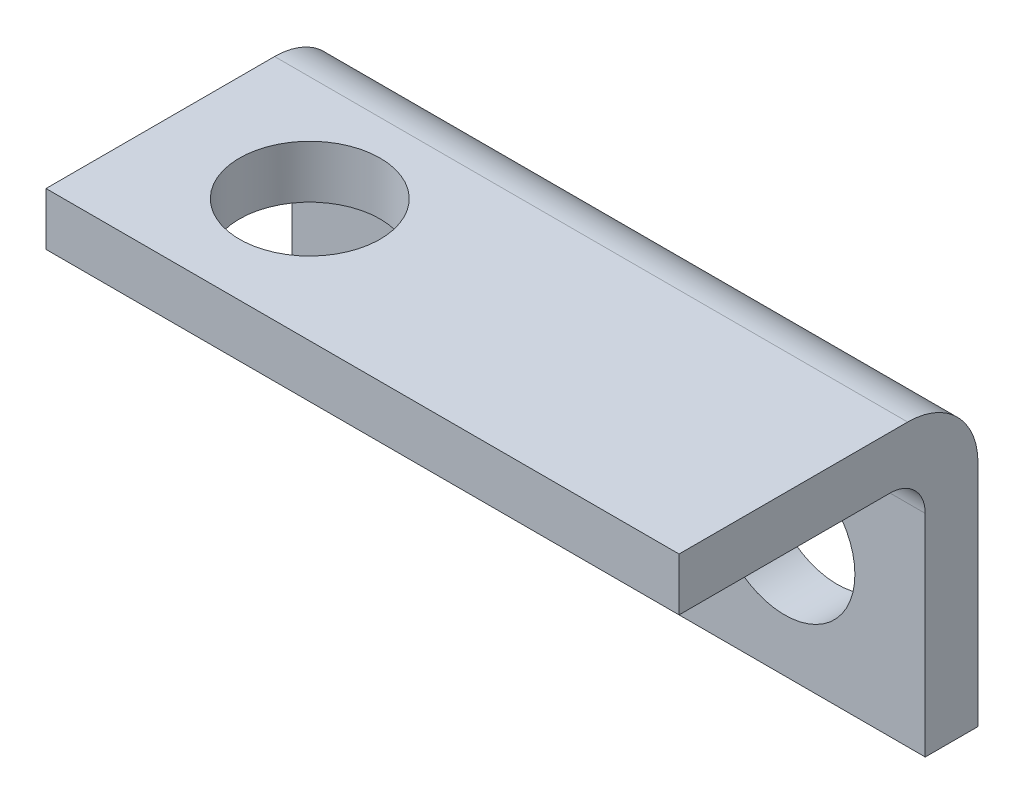
ISO-10303-21;
HEADER;
FILE_DESCRIPTION(('STEP AP214'),'2;1');
FILE_NAME('part.step','',(''),(''),'','','');
FILE_SCHEMA(('AUTOMOTIVE_DESIGN { 1 0 10303 214 1 1 1 1 }'));
ENDSEC;
DATA;
#1=APPLICATION_CONTEXT('core data for automotive mechanical design processes');
#2=APPLICATION_PROTOCOL_DEFINITION('international standard','automotive_design',2000,#1);
#3=PRODUCT_CONTEXT('',#1,'mechanical');
#4=PRODUCT('Part','Part','',(#3));
#5=PRODUCT_RELATED_PRODUCT_CATEGORY('part','',(#4));
#6=PRODUCT_DEFINITION_FORMATION('','',#4);
#7=PRODUCT_DEFINITION_CONTEXT('part definition',#1,'design');
#8=PRODUCT_DEFINITION('design','',#6,#7);
#9=PRODUCT_DEFINITION_SHAPE('','',#8);
#10=(LENGTH_UNIT() NAMED_UNIT(*) SI_UNIT(.MILLI.,.METRE.));
#11=(NAMED_UNIT(*) PLANE_ANGLE_UNIT() SI_UNIT($,.RADIAN.));
#12=(NAMED_UNIT(*) SI_UNIT($,.STERADIAN.) SOLID_ANGLE_UNIT());
#13=UNCERTAINTY_MEASURE_WITH_UNIT(LENGTH_MEASURE(1.E-05),#10,'distance_accuracy_value','');
#14=(GEOMETRIC_REPRESENTATION_CONTEXT(3) GLOBAL_UNCERTAINTY_ASSIGNED_CONTEXT((#13)) GLOBAL_UNIT_ASSIGNED_CONTEXT((#10,
#11,#12)) REPRESENTATION_CONTEXT('',''));
#15=CARTESIAN_POINT('',(0.,0.,0.));
#16=DIRECTION('',(0.,0.,1.));
#17=DIRECTION('',(1.,0.,0.));
#18=AXIS2_PLACEMENT_3D('',#15,#16,#17);
#19=CARTESIAN_POINT('',(18.,8.5,3.));
#20=DIRECTION('',(-1.,0.,0.));
#21=DIRECTION('',(0.,-1.,0.));
#22=AXIS2_PLACEMENT_3D('',#19,#20,#21);
#23=PLANE('',#22);
#24=DIRECTION('',(0.,1.,0.));
#25=VECTOR('',#24,1.);
#26=CARTESIAN_POINT('',(18.,8.5,0.));
#27=LINE('',#26,#25);
#28=CARTESIAN_POINT('',(18.,-8.5,0.));
#29=VERTEX_POINT('',#28);
#30=CARTESIAN_POINT('',(18.,4.5,0.));
#31=VERTEX_POINT('',#30);
#32=EDGE_CURVE('E138',#29,#31,#27,.T.);
#33=ORIENTED_EDGE('',*,*,#32,.T.);
#34=CARTESIAN_POINT('',(18.,4.5,4.));
#35=DIRECTION('',(-1.,0.,0.));
#36=DIRECTION('',(0.,-1.,0.));
#37=AXIS2_PLACEMENT_3D('',#34,#35,#36);
#38=CIRCLE('',#37,4.);
#39=CARTESIAN_POINT('',(18.,8.5,4.));
#40=VERTEX_POINT('',#39);
#41=EDGE_CURVE('E11',#31,#40,#38,.F.);
#42=ORIENTED_EDGE('',*,*,#41,.T.);
#43=DIRECTION('',(0.,0.,-1.));
#44=VECTOR('',#43,1.);
#45=CARTESIAN_POINT('',(18.,8.5,3.));
#46=LINE('',#45,#44);
#47=CARTESIAN_POINT('',(18.,8.5,17.));
#48=VERTEX_POINT('',#47);
#49=EDGE_CURVE('E110',#48,#40,#46,.T.);
#50=ORIENTED_EDGE('',*,*,#49,.F.);
#51=DIRECTION('',(0.,1.,0.));
#52=VECTOR('',#51,1.);
#53=CARTESIAN_POINT('',(18.,5.50000000000001,17.));
#54=LINE('',#53,#52);
#55=CARTESIAN_POINT('',(18.,5.50000000000001,17.));
#56=VERTEX_POINT('',#55);
#57=EDGE_CURVE('E125',#56,#48,#54,.T.);
#58=ORIENTED_EDGE('',*,*,#57,.F.);
#59=DIRECTION('',(0.,0.,-1.));
#60=VECTOR('',#59,1.);
#61=CARTESIAN_POINT('',(18.,5.50000000000001,17.));
#62=LINE('',#61,#60);
#63=CARTESIAN_POINT('',(18.,5.50000000000001,5.));
#64=VERTEX_POINT('',#63);
#65=EDGE_CURVE('E134',#56,#64,#62,.T.);
#66=ORIENTED_EDGE('',*,*,#65,.T.);
#67=CARTESIAN_POINT('',(18.,3.50000000000001,5.));
#68=DIRECTION('',(-1.,0.,0.));
#69=DIRECTION('',(0.,-1.,0.));
#70=AXIS2_PLACEMENT_3D('',#67,#68,#69);
#71=CIRCLE('',#70,2.);
#72=CARTESIAN_POINT('',(18.,3.50000000000001,3.));
#73=VERTEX_POINT('',#72);
#74=EDGE_CURVE('E162',#64,#73,#71,.T.);
#75=ORIENTED_EDGE('',*,*,#74,.T.);
#76=DIRECTION('',(0.,1.,0.));
#77=VECTOR('',#76,1.);
#78=CARTESIAN_POINT('',(18.,8.5,3.));
#79=LINE('',#78,#77);
#80=CARTESIAN_POINT('',(18.,-8.5,3.));
#81=VERTEX_POINT('',#80);
#82=EDGE_CURVE('E139',#81,#73,#79,.T.);
#83=ORIENTED_EDGE('',*,*,#82,.F.);
#84=DIRECTION('',(0.,0.,-1.));
#85=VECTOR('',#84,1.);
#86=CARTESIAN_POINT('',(18.,-8.5,3.));
#87=LINE('',#86,#85);
#88=EDGE_CURVE('E147',#81,#29,#87,.T.);
#89=ORIENTED_EDGE('',*,*,#88,.T.);
#90=EDGE_LOOP('',(#33,#42,#50,#58,#66,#75,#83,#89));
#91=FACE_BOUND('',#90,.T.);
#92=ADVANCED_FACE('F37',(#91),#23,.F.);
#93=CARTESIAN_POINT('',(-18.,8.5,3.));
#94=DIRECTION('',(0.,-1.,0.));
#95=DIRECTION('',(0.,0.,-1.));
#96=AXIS2_PLACEMENT_3D('',#93,#94,#95);
#97=PLANE('',#96);
#98=CARTESIAN_POINT('',(-10.,8.5,10.));
#99=DIRECTION('',(0.,-1.,0.));
#100=DIRECTION('',(0.,0.,-1.));
#101=AXIS2_PLACEMENT_3D('',#98,#99,#100);
#102=CIRCLE('',#101,4.);
#103=CARTESIAN_POINT('',(-10.,8.5,6.));
#104=VERTEX_POINT('',#103);
#105=EDGE_CURVE('E128',#104,#104,#102,.T.);
#106=ORIENTED_EDGE('',*,*,#105,.T.);
#107=EDGE_LOOP('',(#106));
#108=FACE_BOUND('',#107,.T.);
#109=ORIENTED_EDGE('',*,*,#49,.T.);
#110=DIRECTION('',(-1.,0.,0.));
#111=VECTOR('',#110,1.);
#112=CARTESIAN_POINT('',(-18.,8.5,4.));
#113=LINE('',#112,#111);
#114=CARTESIAN_POINT('',(-18.,8.5,4.));
#115=VERTEX_POINT('',#114);
#116=EDGE_CURVE('E109',#40,#115,#113,.T.);
#117=ORIENTED_EDGE('',*,*,#116,.T.);
#118=DIRECTION('',(0.,0.,-1.));
#119=VECTOR('',#118,1.);
#120=CARTESIAN_POINT('',(-18.,8.5,3.));
#121=LINE('',#120,#119);
#122=CARTESIAN_POINT('',(-18.,8.5,17.));
#123=VERTEX_POINT('',#122);
#124=EDGE_CURVE('E102',#123,#115,#121,.T.);
#125=ORIENTED_EDGE('',*,*,#124,.F.);
#126=DIRECTION('',(-1.,0.,0.));
#127=VECTOR('',#126,1.);
#128=CARTESIAN_POINT('',(18.,8.5,17.));
#129=LINE('',#128,#127);
#130=EDGE_CURVE('E107',#48,#123,#129,.T.);
#131=ORIENTED_EDGE('',*,*,#130,.F.);
#132=EDGE_LOOP('',(#109,#117,#125,#131));
#133=FACE_BOUND('',#132,.T.);
#134=ADVANCED_FACE('F105',(#108,#133),#97,.F.);
#135=CARTESIAN_POINT('',(-18.,8.5,3.));
#136=DIRECTION('',(1.,0.,0.));
#137=DIRECTION('',(0.,0.,-1.));
#138=AXIS2_PLACEMENT_3D('',#135,#136,#137);
#139=PLANE('',#138);
#140=ORIENTED_EDGE('',*,*,#124,.T.);
#141=CARTESIAN_POINT('',(-18.,4.5,4.));
#142=DIRECTION('',(1.,0.,0.));
#143=DIRECTION('',(0.,0.,-1.));
#144=AXIS2_PLACEMENT_3D('',#141,#142,#143);
#145=CIRCLE('',#144,4.);
#146=CARTESIAN_POINT('',(-18.,4.5,0.));
#147=VERTEX_POINT('',#146);
#148=EDGE_CURVE('E60',#115,#147,#145,.F.);
#149=ORIENTED_EDGE('',*,*,#148,.T.);
#150=DIRECTION('',(0.,-1.,0.));
#151=VECTOR('',#150,1.);
#152=CARTESIAN_POINT('',(-18.,8.5,0.));
#153=LINE('',#152,#151);
#154=CARTESIAN_POINT('',(-18.,-8.5,0.));
#155=VERTEX_POINT('',#154);
#156=EDGE_CURVE('E149',#147,#155,#153,.T.);
#157=ORIENTED_EDGE('',*,*,#156,.T.);
#158=DIRECTION('',(0.,0.,-1.));
#159=VECTOR('',#158,1.);
#160=CARTESIAN_POINT('',(-18.,-8.5,3.));
#161=LINE('',#160,#159);
#162=CARTESIAN_POINT('',(-18.,-8.5,3.));
#163=VERTEX_POINT('',#162);
#164=EDGE_CURVE('E111',#163,#155,#161,.T.);
#165=ORIENTED_EDGE('',*,*,#164,.F.);
#166=DIRECTION('',(0.,-1.,0.));
#167=VECTOR('',#166,1.);
#168=CARTESIAN_POINT('',(-18.,8.5,3.));
#169=LINE('',#168,#167);
#170=CARTESIAN_POINT('',(-18.,3.5,3.));
#171=VERTEX_POINT('',#170);
#172=EDGE_CURVE('E142',#171,#163,#169,.T.);
#173=ORIENTED_EDGE('',*,*,#172,.F.);
#174=CARTESIAN_POINT('',(-18.,3.5,5.));
#175=DIRECTION('',(1.,0.,0.));
#176=DIRECTION('',(0.,0.,-1.));
#177=AXIS2_PLACEMENT_3D('',#174,#175,#176);
#178=CIRCLE('',#177,2.);
#179=CARTESIAN_POINT('',(-18.,5.5,5.));
#180=VERTEX_POINT('',#179);
#181=EDGE_CURVE('E164',#171,#180,#178,.T.);
#182=ORIENTED_EDGE('',*,*,#181,.T.);
#183=DIRECTION('',(0.,0.,-1.));
#184=VECTOR('',#183,1.);
#185=CARTESIAN_POINT('',(-18.,5.5,17.));
#186=LINE('',#185,#184);
#187=CARTESIAN_POINT('',(-18.,5.5,17.));
#188=VERTEX_POINT('',#187);
#189=EDGE_CURVE('E117',#188,#180,#186,.T.);
#190=ORIENTED_EDGE('',*,*,#189,.F.);
#191=DIRECTION('',(0.,-1.,0.));
#192=VECTOR('',#191,1.);
#193=CARTESIAN_POINT('',(-18.,8.5,17.));
#194=LINE('',#193,#192);
#195=EDGE_CURVE('E114',#123,#188,#194,.T.);
#196=ORIENTED_EDGE('',*,*,#195,.F.);
#197=EDGE_LOOP('',(#140,#149,#157,#165,#173,#182,#190,#196));
#198=FACE_BOUND('',#197,.T.);
#199=ADVANCED_FACE('F115',(#198),#139,.F.);
#200=CARTESIAN_POINT('',(-18.,-8.5,3.));
#201=DIRECTION('',(0.,1.,0.));
#202=DIRECTION('',(0.,0.,1.));
#203=AXIS2_PLACEMENT_3D('',#200,#201,#202);
#204=PLANE('',#203);
#205=DIRECTION('',(1.,0.,0.));
#206=VECTOR('',#205,1.);
#207=CARTESIAN_POINT('',(-18.,-8.5,0.));
#208=LINE('',#207,#206);
#209=EDGE_CURVE('E143',#155,#29,#208,.T.);
#210=ORIENTED_EDGE('',*,*,#209,.T.);
#211=ORIENTED_EDGE('',*,*,#88,.F.);
#212=DIRECTION('',(1.,0.,0.));
#213=VECTOR('',#212,1.);
#214=CARTESIAN_POINT('',(-18.,-8.5,3.));
#215=LINE('',#214,#213);
#216=EDGE_CURVE('E145',#163,#81,#215,.T.);
#217=ORIENTED_EDGE('',*,*,#216,.F.);
#218=ORIENTED_EDGE('',*,*,#164,.T.);
#219=EDGE_LOOP('',(#210,#211,#217,#218));
#220=FACE_BOUND('',#219,.T.);
#221=ADVANCED_FACE('F185',(#220),#204,.F.);
#222=CARTESIAN_POINT('',(0.,0.,3.));
#223=DIRECTION('',(0.,0.,1.));
#224=DIRECTION('',(1.,0.,0.));
#225=AXIS2_PLACEMENT_3D('',#222,#223,#224);
#226=PLANE('',#225);
#227=CARTESIAN_POINT('',(10.,-1.5,3.));
#228=DIRECTION('',(0.,0.,1.));
#229=DIRECTION('',(1.,0.,0.));
#230=AXIS2_PLACEMENT_3D('',#227,#228,#229);
#231=CIRCLE('',#230,4.);
#232=CARTESIAN_POINT('',(14.,-1.5,3.));
#233=VERTEX_POINT('',#232);
#234=EDGE_CURVE('E229',#233,#233,#231,.T.);
#235=ORIENTED_EDGE('',*,*,#234,.F.);
#236=EDGE_LOOP('',(#235));
#237=FACE_BOUND('',#236,.T.);
#238=ORIENTED_EDGE('',*,*,#82,.T.);
#239=DIRECTION('',(1.,0.,0.));
#240=VECTOR('',#239,1.);
#241=CARTESIAN_POINT('',(0.,3.50000000000001,3.));
#242=LINE('',#241,#240);
#243=EDGE_CURVE('E160',#73,#171,#242,.F.);
#244=ORIENTED_EDGE('',*,*,#243,.T.);
#245=ORIENTED_EDGE('',*,*,#172,.T.);
#246=ORIENTED_EDGE('',*,*,#216,.T.);
#247=EDGE_LOOP('',(#238,#244,#245,#246));
#248=FACE_BOUND('',#247,.T.);
#249=ADVANCED_FACE('F181',(#237,#248),#226,.T.);
#250=CARTESIAN_POINT('',(0.,0.,0.));
#251=DIRECTION('',(0.,0.,1.));
#252=DIRECTION('',(1.,0.,0.));
#253=AXIS2_PLACEMENT_3D('',#250,#251,#252);
#254=PLANE('',#253);
#255=CARTESIAN_POINT('',(10.,-1.5,0.));
#256=DIRECTION('',(0.,0.,1.));
#257=DIRECTION('',(1.,0.,0.));
#258=AXIS2_PLACEMENT_3D('',#255,#256,#257);
#259=CIRCLE('',#258,4.);
#260=CARTESIAN_POINT('',(14.,-1.5,0.));
#261=VERTEX_POINT('',#260);
#262=EDGE_CURVE('E232',#261,#261,#259,.T.);
#263=ORIENTED_EDGE('',*,*,#262,.T.);
#264=EDGE_LOOP('',(#263));
#265=FACE_BOUND('',#264,.T.);
#266=ORIENTED_EDGE('',*,*,#156,.F.);
#267=DIRECTION('',(-1.,0.,0.));
#268=VECTOR('',#267,1.);
#269=CARTESIAN_POINT('',(0.,4.5,0.));
#270=LINE('',#269,#268);
#271=EDGE_CURVE('E46',#147,#31,#270,.F.);
#272=ORIENTED_EDGE('',*,*,#271,.T.);
#273=ORIENTED_EDGE('',*,*,#32,.F.);
#274=ORIENTED_EDGE('',*,*,#209,.F.);
#275=EDGE_LOOP('',(#266,#272,#273,#274));
#276=FACE_BOUND('',#275,.T.);
#277=ADVANCED_FACE('F188',(#265,#276),#254,.F.);
#278=CARTESIAN_POINT('',(-18.,5.5,17.));
#279=DIRECTION('',(0.,1.,0.));
#280=DIRECTION('',(-1.,0.,0.));
#281=AXIS2_PLACEMENT_3D('',#278,#279,#280);
#282=PLANE('',#281);
#283=CARTESIAN_POINT('',(-10.,5.5,10.));
#284=DIRECTION('',(0.,1.,0.));
#285=DIRECTION('',(-1.,0.,0.));
#286=AXIS2_PLACEMENT_3D('',#283,#284,#285);
#287=CIRCLE('',#286,4.);
#288=CARTESIAN_POINT('',(-14.,5.5,10.));
#289=VERTEX_POINT('',#288);
#290=EDGE_CURVE('E41',#289,#289,#287,.T.);
#291=ORIENTED_EDGE('',*,*,#290,.T.);
#292=EDGE_LOOP('',(#291));
#293=FACE_BOUND('',#292,.T.);
#294=ORIENTED_EDGE('',*,*,#189,.T.);
#295=DIRECTION('',(1.,0.,0.));
#296=VECTOR('',#295,1.);
#297=CARTESIAN_POINT('',(-18.,5.5,5.));
#298=LINE('',#297,#296);
#299=EDGE_CURVE('E157',#180,#64,#298,.T.);
#300=ORIENTED_EDGE('',*,*,#299,.T.);
#301=ORIENTED_EDGE('',*,*,#65,.F.);
#302=DIRECTION('',(1.,0.,0.));
#303=VECTOR('',#302,1.);
#304=CARTESIAN_POINT('',(-18.,5.5,17.));
#305=LINE('',#304,#303);
#306=EDGE_CURVE('E120',#188,#56,#305,.T.);
#307=ORIENTED_EDGE('',*,*,#306,.F.);
#308=EDGE_LOOP('',(#294,#300,#301,#307));
#309=FACE_BOUND('',#308,.T.);
#310=ADVANCED_FACE('F175',(#293,#309),#282,.F.);
#311=CARTESIAN_POINT('',(0.,0.,17.));
#312=DIRECTION('',(0.,0.,1.));
#313=DIRECTION('',(1.,0.,0.));
#314=AXIS2_PLACEMENT_3D('',#311,#312,#313);
#315=PLANE('',#314);
#316=ORIENTED_EDGE('',*,*,#130,.T.);
#317=ORIENTED_EDGE('',*,*,#195,.T.);
#318=ORIENTED_EDGE('',*,*,#306,.T.);
#319=ORIENTED_EDGE('',*,*,#57,.T.);
#320=EDGE_LOOP('',(#316,#317,#318,#319));
#321=FACE_BOUND('',#320,.T.);
#322=ADVANCED_FACE('F123',(#321),#315,.T.);
#323=CARTESIAN_POINT('',(-18.,3.5,5.));
#324=DIRECTION('',(1.,0.,0.));
#325=DIRECTION('',(0.,1.,0.));
#326=AXIS2_PLACEMENT_3D('',#323,#324,#325);
#327=CYLINDRICAL_SURFACE('',#326,2.);
#328=ORIENTED_EDGE('',*,*,#181,.F.);
#329=ORIENTED_EDGE('',*,*,#243,.F.);
#330=ORIENTED_EDGE('',*,*,#74,.F.);
#331=ORIENTED_EDGE('',*,*,#299,.F.);
#332=EDGE_LOOP('',(#328,#329,#330,#331));
#333=FACE_BOUND('',#332,.T.);
#334=ADVANCED_FACE('F177',(#333),#327,.F.);
#335=CARTESIAN_POINT('',(-18.,4.5,4.));
#336=DIRECTION('',(-1.,0.,0.));
#337=DIRECTION('',(0.,0.,1.));
#338=AXIS2_PLACEMENT_3D('',#335,#336,#337);
#339=CYLINDRICAL_SURFACE('',#338,4.);
#340=ORIENTED_EDGE('',*,*,#41,.F.);
#341=ORIENTED_EDGE('',*,*,#271,.F.);
#342=ORIENTED_EDGE('',*,*,#148,.F.);
#343=ORIENTED_EDGE('',*,*,#116,.F.);
#344=EDGE_LOOP('',(#340,#341,#342,#343));
#345=FACE_BOUND('',#344,.T.);
#346=ADVANCED_FACE('F39',(#345),#339,.T.);
#347=CARTESIAN_POINT('',(-10.,8.5,10.));
#348=DIRECTION('',(0.,-1.,0.));
#349=DIRECTION('',(0.,0.,-1.));
#350=AXIS2_PLACEMENT_3D('',#347,#348,#349);
#351=CYLINDRICAL_SURFACE('',#350,4.);
#352=ORIENTED_EDGE('',*,*,#105,.F.);
#353=EDGE_LOOP('',(#352));
#354=FACE_BOUND('',#353,.T.);
#355=ORIENTED_EDGE('',*,*,#290,.F.);
#356=EDGE_LOOP('',(#355));
#357=FACE_BOUND('',#356,.T.);
#358=ADVANCED_FACE('F191',(#354,#357),#351,.F.);
#359=CARTESIAN_POINT('',(10.,-1.5,0.));
#360=DIRECTION('',(0.,0.,1.));
#361=DIRECTION('',(1.,0.,0.));
#362=AXIS2_PLACEMENT_3D('',#359,#360,#361);
#363=CYLINDRICAL_SURFACE('',#362,4.);
#364=ORIENTED_EDGE('',*,*,#234,.T.);
#365=EDGE_LOOP('',(#364));
#366=FACE_BOUND('',#365,.T.);
#367=ORIENTED_EDGE('',*,*,#262,.F.);
#368=EDGE_LOOP('',(#367));
#369=FACE_BOUND('',#368,.T.);
#370=ADVANCED_FACE('F196',(#366,#369),#363,.F.);
#371=CLOSED_SHELL('',(#92,#134,#199,#221,#249,#277,#310,#322,#334,#346,#358,#370));
#372=MANIFOLD_SOLID_BREP('B2',#371);
#373=ADVANCED_BREP_SHAPE_REPRESENTATION('',(#18,#372),#14);
#374=SHAPE_DEFINITION_REPRESENTATION(#9,#373);
ENDSEC;
END-ISO-10303-21;
